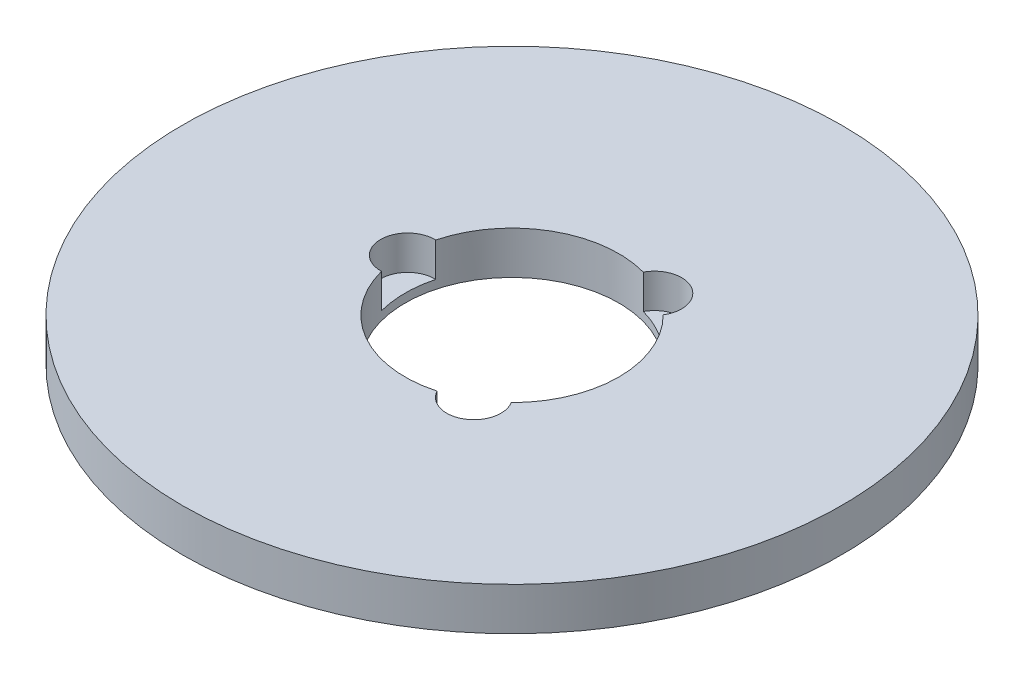
ISO-10303-21;
HEADER;
FILE_DESCRIPTION(('STEP AP214'),'2;1');
FILE_NAME('part.step','',(''),(''),'','','');
FILE_SCHEMA(('AUTOMOTIVE_DESIGN { 1 0 10303 214 1 1 1 1 }'));
ENDSEC;
DATA;
#1=APPLICATION_CONTEXT('core data for automotive mechanical design processes');
#2=APPLICATION_PROTOCOL_DEFINITION('international standard','automotive_design',2000,#1);
#3=PRODUCT_CONTEXT('',#1,'mechanical');
#4=PRODUCT('Part','Part','',(#3));
#5=PRODUCT_RELATED_PRODUCT_CATEGORY('part','',(#4));
#6=PRODUCT_DEFINITION_FORMATION('','',#4);
#7=PRODUCT_DEFINITION_CONTEXT('part definition',#1,'design');
#8=PRODUCT_DEFINITION('design','',#6,#7);
#9=PRODUCT_DEFINITION_SHAPE('','',#8);
#10=(LENGTH_UNIT() NAMED_UNIT(*) SI_UNIT(.MILLI.,.METRE.));
#11=(NAMED_UNIT(*) PLANE_ANGLE_UNIT() SI_UNIT($,.RADIAN.));
#12=(NAMED_UNIT(*) SI_UNIT($,.STERADIAN.) SOLID_ANGLE_UNIT());
#13=UNCERTAINTY_MEASURE_WITH_UNIT(LENGTH_MEASURE(1.E-05),#10,'distance_accuracy_value','');
#14=(GEOMETRIC_REPRESENTATION_CONTEXT(3) GLOBAL_UNCERTAINTY_ASSIGNED_CONTEXT((#13)) GLOBAL_UNIT_ASSIGNED_CONTEXT((#10,
#11,#12)) REPRESENTATION_CONTEXT('',''));
#15=CARTESIAN_POINT('',(0.,0.,0.));
#16=DIRECTION('',(0.,0.,1.));
#17=DIRECTION('',(1.,0.,0.));
#18=AXIS2_PLACEMENT_3D('',#15,#16,#17);
#19=CARTESIAN_POINT('',(0.,12.,0.));
#20=DIRECTION('',(0.,-1.,0.));
#21=DIRECTION('',(0.,0.,-1.));
#22=AXIS2_PLACEMENT_3D('',#19,#20,#21);
#23=CYLINDRICAL_SURFACE('',#22,92.5);
#24=CARTESIAN_POINT('',(0.,12.,0.));
#25=DIRECTION('',(0.,1.,0.));
#26=DIRECTION('',(0.,0.,1.));
#27=AXIS2_PLACEMENT_3D('',#24,#25,#26);
#28=CIRCLE('',#27,92.5);
#29=CARTESIAN_POINT('',(0.,12.,92.5));
#30=VERTEX_POINT('',#29);
#31=EDGE_CURVE('E126',#30,#30,#28,.T.);
#32=ORIENTED_EDGE('',*,*,#31,.F.);
#33=EDGE_LOOP('',(#32));
#34=FACE_BOUND('',#33,.T.);
#35=CARTESIAN_POINT('',(0.,0.,0.));
#36=DIRECTION('',(0.,1.,0.));
#37=DIRECTION('',(0.,0.,1.));
#38=AXIS2_PLACEMENT_3D('',#35,#36,#37);
#39=CIRCLE('',#38,92.5);
#40=CARTESIAN_POINT('',(0.,0.,92.5));
#41=VERTEX_POINT('',#40);
#42=EDGE_CURVE('E124',#41,#41,#39,.T.);
#43=ORIENTED_EDGE('',*,*,#42,.T.);
#44=EDGE_LOOP('',(#43));
#45=FACE_BOUND('',#44,.T.);
#46=ADVANCED_FACE('F39',(#34,#45),#23,.T.);
#47=CARTESIAN_POINT('',(0.,12.,0.));
#48=DIRECTION('',(0.,1.,0.));
#49=DIRECTION('',(0.,0.,1.));
#50=AXIS2_PLACEMENT_3D('',#47,#48,#49);
#51=PLANE('',#50);
#52=CARTESIAN_POINT('',(14.6362995862756,12.,25.3508145182285));
#53=DIRECTION('',(0.,1.,0.));
#54=DIRECTION('',(0.866025403784436,0.,-0.500000000000004));
#55=AXIS2_PLACEMENT_3D('',#52,#53,#54);
#56=CIRCLE('',#55,7.61441907072702);
#57=CARTESIAN_POINT('',(7.91873772333031,12.,28.9360258651582));
#58=VERTEX_POINT('',#57);
#59=CARTESIAN_POINT('',(21.0999646221256,12.,21.3258409668891));
#60=VERTEX_POINT('',#59);
#61=EDGE_CURVE('E147',#58,#60,#56,.T.);
#62=ORIENTED_EDGE('',*,*,#61,.F.);
#63=CARTESIAN_POINT('',(0.,12.,0.));
#64=DIRECTION('',(0.,1.,0.));
#65=DIRECTION('',(0.,0.,1.));
#66=AXIS2_PLACEMENT_3D('',#63,#64,#65);
#67=CIRCLE('',#66,30.);
#68=CARTESIAN_POINT('',(-29.0187023454557,12.,7.61018489826904));
#69=VERTEX_POINT('',#68);
#70=EDGE_CURVE('E118',#69,#58,#67,.T.);
#71=ORIENTED_EDGE('',*,*,#70,.F.);
#72=CARTESIAN_POINT('',(-29.272599172551,12.,0.));
#73=DIRECTION('',(0.,1.,0.));
#74=DIRECTION('',(0.,0.,1.));
#75=AXIS2_PLACEMENT_3D('',#72,#73,#74);
#76=CIRCLE('',#75,7.61441907072702);
#77=CARTESIAN_POINT('',(-29.0187023454557,12.,-7.61018489826904));
#78=VERTEX_POINT('',#77);
#79=EDGE_CURVE('E113',#78,#69,#76,.T.);
#80=ORIENTED_EDGE('',*,*,#79,.F.);
#81=CARTESIAN_POINT('',(7.91873772332991,12.,-28.9360258651583));
#82=VERTEX_POINT('',#81);
#83=EDGE_CURVE('E106',#82,#78,#67,.T.);
#84=ORIENTED_EDGE('',*,*,#83,.F.);
#85=CARTESIAN_POINT('',(14.6362995862753,12.,-25.3508145182287));
#86=DIRECTION('',(0.,1.,0.));
#87=DIRECTION('',(-0.866025403784443,0.,-0.499999999999992));
#88=AXIS2_PLACEMENT_3D('',#85,#86,#87);
#89=CIRCLE('',#88,7.61441907072702);
#90=CARTESIAN_POINT('',(21.0999646221254,12.,-21.3258409668894));
#91=VERTEX_POINT('',#90);
#92=EDGE_CURVE('E90',#91,#82,#89,.T.);
#93=ORIENTED_EDGE('',*,*,#92,.F.);
#94=EDGE_CURVE('E116',#60,#91,#67,.T.);
#95=ORIENTED_EDGE('',*,*,#94,.F.);
#96=EDGE_LOOP('',(#62,#71,#80,#84,#93,#95));
#97=FACE_BOUND('',#96,.T.);
#98=ORIENTED_EDGE('',*,*,#31,.T.);
#99=EDGE_LOOP('',(#98));
#100=FACE_BOUND('',#99,.T.);
#101=ADVANCED_FACE('F115',(#97,#100),#51,.T.);
#102=CARTESIAN_POINT('',(0.,0.,0.));
#103=DIRECTION('',(0.,1.,0.));
#104=DIRECTION('',(0.,0.,1.));
#105=AXIS2_PLACEMENT_3D('',#102,#103,#104);
#106=PLANE('',#105);
#107=CARTESIAN_POINT('',(0.,0.,0.));
#108=DIRECTION('',(0.,1.,0.));
#109=DIRECTION('',(0.,0.,1.));
#110=AXIS2_PLACEMENT_3D('',#107,#108,#109);
#111=CIRCLE('',#110,30.);
#112=CARTESIAN_POINT('',(0.,0.,30.));
#113=VERTEX_POINT('',#112);
#114=EDGE_CURVE('E120',#113,#113,#111,.T.);
#115=ORIENTED_EDGE('',*,*,#114,.T.);
#116=EDGE_LOOP('',(#115));
#117=FACE_BOUND('',#116,.T.);
#118=ORIENTED_EDGE('',*,*,#42,.F.);
#119=EDGE_LOOP('',(#118));
#120=FACE_BOUND('',#119,.T.);
#121=ADVANCED_FACE('F164',(#117,#120),#106,.F.);
#122=CARTESIAN_POINT('',(0.,12.,0.));
#123=DIRECTION('',(0.,-1.,0.));
#124=DIRECTION('',(0.,0.,-1.));
#125=AXIS2_PLACEMENT_3D('',#122,#123,#124);
#126=CYLINDRICAL_SURFACE('',#125,30.);
#127=DIRECTION('',(0.,1.,0.));
#128=VECTOR('',#127,1.);
#129=CARTESIAN_POINT('',(7.91873772333031,7.20864101682973,28.9360258651582));
#130=LINE('',#129,#128);
#131=CARTESIAN_POINT('',(7.91873772333031,2.41728203365945,28.9360258651582));
#132=VERTEX_POINT('',#131);
#133=EDGE_CURVE('E11',#132,#58,#130,.T.);
#134=ORIENTED_EDGE('',*,*,#133,.F.);
#135=CARTESIAN_POINT('',(0.,2.41728203365945,0.));
#136=DIRECTION('',(0.,1.,0.));
#137=DIRECTION('',(0.,0.,1.));
#138=AXIS2_PLACEMENT_3D('',#135,#136,#137);
#139=CIRCLE('',#138,30.);
#140=CARTESIAN_POINT('',(21.0999646221256,2.41728203365945,21.3258409668891));
#141=VERTEX_POINT('',#140);
#142=EDGE_CURVE('E144',#132,#141,#139,.T.);
#143=ORIENTED_EDGE('',*,*,#142,.T.);
#144=DIRECTION('',(0.,1.,0.));
#145=VECTOR('',#144,1.);
#146=CARTESIAN_POINT('',(21.0999646221256,7.20864101682973,21.3258409668891));
#147=LINE('',#146,#145);
#148=EDGE_CURVE('E46',#60,#141,#147,.F.);
#149=ORIENTED_EDGE('',*,*,#148,.F.);
#150=ORIENTED_EDGE('',*,*,#94,.T.);
#151=DIRECTION('',(0.,1.,0.));
#152=VECTOR('',#151,1.);
#153=CARTESIAN_POINT('',(21.0999646221253,7.20864101682973,-21.3258409668894));
#154=LINE('',#153,#152);
#155=CARTESIAN_POINT('',(21.0999646221254,2.41728203365945,-21.3258409668894));
#156=VERTEX_POINT('',#155);
#157=EDGE_CURVE('E92',#156,#91,#154,.T.);
#158=ORIENTED_EDGE('',*,*,#157,.F.);
#159=CARTESIAN_POINT('',(0.,2.41728203365945,0.));
#160=DIRECTION('',(0.,1.,0.));
#161=DIRECTION('',(0.,0.,1.));
#162=AXIS2_PLACEMENT_3D('',#159,#160,#161);
#163=CIRCLE('',#162,30.);
#164=CARTESIAN_POINT('',(7.91873772332991,2.41728203365945,-28.9360258651583));
#165=VERTEX_POINT('',#164);
#166=EDGE_CURVE('E107',#156,#165,#163,.T.);
#167=ORIENTED_EDGE('',*,*,#166,.T.);
#168=DIRECTION('',(0.,1.,0.));
#169=VECTOR('',#168,1.);
#170=CARTESIAN_POINT('',(7.91873772332991,7.20864101682973,-28.9360258651583));
#171=LINE('',#170,#169);
#172=EDGE_CURVE('E95',#82,#165,#171,.F.);
#173=ORIENTED_EDGE('',*,*,#172,.F.);
#174=ORIENTED_EDGE('',*,*,#83,.T.);
#175=DIRECTION('',(0.,1.,0.));
#176=VECTOR('',#175,1.);
#177=CARTESIAN_POINT('',(-29.0187023454557,7.20864101682973,-7.61018489826904));
#178=LINE('',#177,#176);
#179=CARTESIAN_POINT('',(-29.0187023454557,2.41728203365945,-7.61018489826904));
#180=VERTEX_POINT('',#179);
#181=EDGE_CURVE('E143',#180,#78,#178,.T.);
#182=ORIENTED_EDGE('',*,*,#181,.F.);
#183=CARTESIAN_POINT('',(0.,2.41728203365945,0.));
#184=DIRECTION('',(0.,1.,0.));
#185=DIRECTION('',(0.,0.,1.));
#186=AXIS2_PLACEMENT_3D('',#183,#184,#185);
#187=CIRCLE('',#186,30.);
#188=CARTESIAN_POINT('',(-29.0187023454557,2.41728203365945,7.61018489826904));
#189=VERTEX_POINT('',#188);
#190=EDGE_CURVE('E132',#180,#189,#187,.T.);
#191=ORIENTED_EDGE('',*,*,#190,.T.);
#192=DIRECTION('',(0.,1.,0.));
#193=VECTOR('',#192,1.);
#194=CARTESIAN_POINT('',(-29.0187023454557,7.20864101682973,7.61018489826904));
#195=LINE('',#194,#193);
#196=EDGE_CURVE('E137',#69,#189,#195,.F.);
#197=ORIENTED_EDGE('',*,*,#196,.F.);
#198=ORIENTED_EDGE('',*,*,#70,.T.);
#199=EDGE_LOOP('',(#134,#143,#149,#150,#158,#167,#173,#174,#182,#191,#197,#198));
#200=FACE_BOUND('',#199,.T.);
#201=ORIENTED_EDGE('',*,*,#114,.F.);
#202=EDGE_LOOP('',(#201));
#203=FACE_BOUND('',#202,.T.);
#204=ADVANCED_FACE('F103',(#200,#203),#126,.F.);
#205=CARTESIAN_POINT('',(-29.272599172551,2.41728203365945,0.));
#206=DIRECTION('',(0.,1.,0.));
#207=DIRECTION('',(0.,0.,1.));
#208=AXIS2_PLACEMENT_3D('',#205,#206,#207);
#209=CYLINDRICAL_SURFACE('',#208,7.61441907072702);
#210=ORIENTED_EDGE('',*,*,#181,.T.);
#211=ORIENTED_EDGE('',*,*,#79,.T.);
#212=ORIENTED_EDGE('',*,*,#196,.T.);
#213=CARTESIAN_POINT('',(-29.272599172551,2.41728203365945,0.));
#214=DIRECTION('',(0.,1.,0.));
#215=DIRECTION('',(0.,0.,1.));
#216=AXIS2_PLACEMENT_3D('',#213,#214,#215);
#217=CIRCLE('',#216,7.61441907072702);
#218=EDGE_CURVE('E121',#180,#189,#217,.T.);
#219=ORIENTED_EDGE('',*,*,#218,.F.);
#220=EDGE_LOOP('',(#210,#211,#212,#219));
#221=FACE_BOUND('',#220,.T.);
#222=ADVANCED_FACE('F174',(#221),#209,.F.);
#223=CARTESIAN_POINT('',(-29.272599172551,2.41728203365945,0.));
#224=DIRECTION('',(0.,1.,0.));
#225=DIRECTION('',(0.,0.,1.));
#226=AXIS2_PLACEMENT_3D('',#223,#224,#225);
#227=PLANE('',#226);
#228=ORIENTED_EDGE('',*,*,#218,.T.);
#229=ORIENTED_EDGE('',*,*,#190,.F.);
#230=EDGE_LOOP('',(#228,#229));
#231=FACE_BOUND('',#230,.T.);
#232=ADVANCED_FACE('F177',(#231),#227,.T.);
#233=CARTESIAN_POINT('',(14.6362995862753,2.41728203365945,-25.3508145182287));
#234=DIRECTION('',(0.,1.,0.));
#235=DIRECTION('',(0.,0.,1.));
#236=AXIS2_PLACEMENT_3D('',#233,#234,#235);
#237=CYLINDRICAL_SURFACE('',#236,7.61441907072702);
#238=ORIENTED_EDGE('',*,*,#157,.T.);
#239=ORIENTED_EDGE('',*,*,#92,.T.);
#240=ORIENTED_EDGE('',*,*,#172,.T.);
#241=CARTESIAN_POINT('',(14.6362995862753,2.41728203365945,-25.3508145182287));
#242=DIRECTION('',(0.,1.,0.));
#243=DIRECTION('',(-0.866025403784443,0.,-0.499999999999992));
#244=AXIS2_PLACEMENT_3D('',#241,#242,#243);
#245=CIRCLE('',#244,7.61441907072702);
#246=EDGE_CURVE('E56',#156,#165,#245,.T.);
#247=ORIENTED_EDGE('',*,*,#246,.F.);
#248=EDGE_LOOP('',(#238,#239,#240,#247));
#249=FACE_BOUND('',#248,.T.);
#250=ADVANCED_FACE('F93',(#249),#237,.F.);
#251=CARTESIAN_POINT('',(14.6362995862753,2.41728203365945,-25.3508145182287));
#252=DIRECTION('',(0.,1.,0.));
#253=DIRECTION('',(-0.866025403784443,0.,-0.499999999999992));
#254=AXIS2_PLACEMENT_3D('',#251,#252,#253);
#255=PLANE('',#254);
#256=ORIENTED_EDGE('',*,*,#246,.T.);
#257=ORIENTED_EDGE('',*,*,#166,.F.);
#258=EDGE_LOOP('',(#256,#257));
#259=FACE_BOUND('',#258,.T.);
#260=ADVANCED_FACE('F160',(#259),#255,.T.);
#261=CARTESIAN_POINT('',(14.6362995862756,2.41728203365945,25.3508145182285));
#262=DIRECTION('',(0.,1.,0.));
#263=DIRECTION('',(0.,0.,1.));
#264=AXIS2_PLACEMENT_3D('',#261,#262,#263);
#265=CYLINDRICAL_SURFACE('',#264,7.61441907072702);
#266=ORIENTED_EDGE('',*,*,#133,.T.);
#267=ORIENTED_EDGE('',*,*,#61,.T.);
#268=ORIENTED_EDGE('',*,*,#148,.T.);
#269=CARTESIAN_POINT('',(14.6362995862756,2.41728203365945,25.3508145182285));
#270=DIRECTION('',(0.,1.,0.));
#271=DIRECTION('',(0.866025403784436,0.,-0.500000000000004));
#272=AXIS2_PLACEMENT_3D('',#269,#270,#271);
#273=CIRCLE('',#272,7.61441907072702);
#274=EDGE_CURVE('E55',#132,#141,#273,.T.);
#275=ORIENTED_EDGE('',*,*,#274,.F.);
#276=EDGE_LOOP('',(#266,#267,#268,#275));
#277=FACE_BOUND('',#276,.T.);
#278=ADVANCED_FACE('F149',(#277),#265,.F.);
#279=CARTESIAN_POINT('',(14.6362995862756,2.41728203365945,25.3508145182285));
#280=DIRECTION('',(0.,1.,0.));
#281=DIRECTION('',(0.866025403784436,0.,-0.500000000000004));
#282=AXIS2_PLACEMENT_3D('',#279,#280,#281);
#283=PLANE('',#282);
#284=ORIENTED_EDGE('',*,*,#274,.T.);
#285=ORIENTED_EDGE('',*,*,#142,.F.);
#286=EDGE_LOOP('',(#284,#285));
#287=FACE_BOUND('',#286,.T.);
#288=ADVANCED_FACE('F151',(#287),#283,.T.);
#289=CLOSED_SHELL('',(#46,#101,#121,#204,#222,#232,#250,#260,#278,#288));
#290=MANIFOLD_SOLID_BREP('B2',#289);
#291=ADVANCED_BREP_SHAPE_REPRESENTATION('',(#18,#290),#14);
#292=SHAPE_DEFINITION_REPRESENTATION(#9,#291);
ENDSEC;
END-ISO-10303-21;
